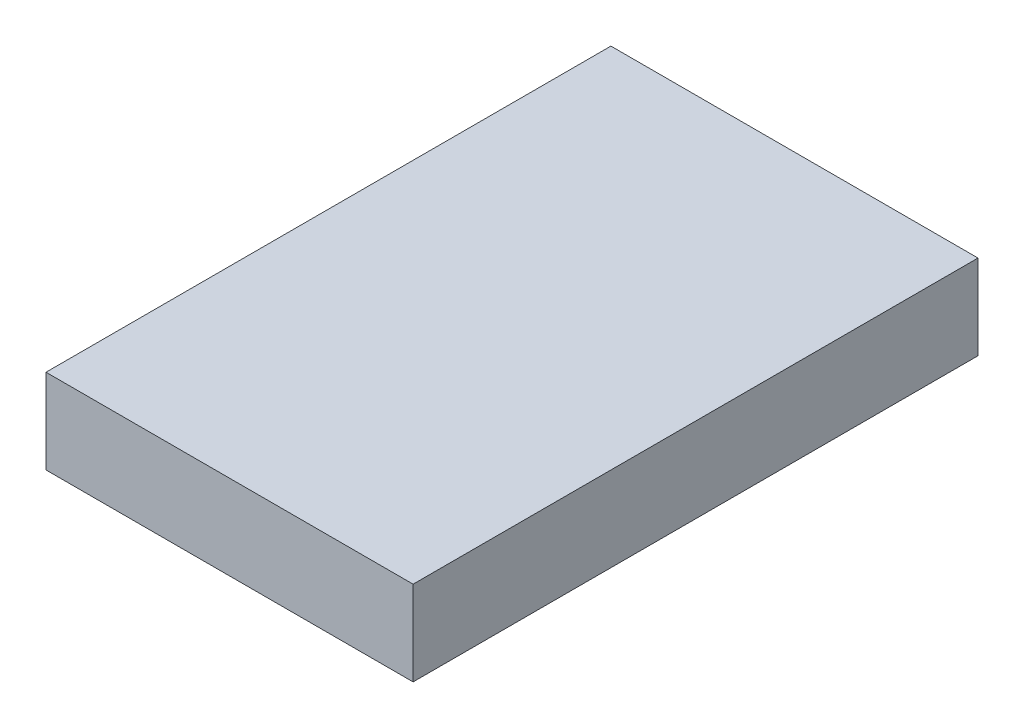
ISO-10303-21;
HEADER;
FILE_DESCRIPTION(('STEP AP214'),'2;1');
FILE_NAME('part.step','',(''),(''),'','','');
FILE_SCHEMA(('AUTOMOTIVE_DESIGN { 1 0 10303 214 1 1 1 1 }'));
ENDSEC;
DATA;
#1=APPLICATION_CONTEXT('core data for automotive mechanical design processes');
#2=APPLICATION_PROTOCOL_DEFINITION('international standard','automotive_design',2000,#1);
#3=PRODUCT_CONTEXT('',#1,'mechanical');
#4=PRODUCT('Part','Part','',(#3));
#5=PRODUCT_RELATED_PRODUCT_CATEGORY('part','',(#4));
#6=PRODUCT_DEFINITION_FORMATION('','',#4);
#7=PRODUCT_DEFINITION_CONTEXT('part definition',#1,'design');
#8=PRODUCT_DEFINITION('design','',#6,#7);
#9=PRODUCT_DEFINITION_SHAPE('','',#8);
#10=(LENGTH_UNIT() NAMED_UNIT(*) SI_UNIT(.MILLI.,.METRE.));
#11=(NAMED_UNIT(*) PLANE_ANGLE_UNIT() SI_UNIT($,.RADIAN.));
#12=(NAMED_UNIT(*) SI_UNIT($,.STERADIAN.) SOLID_ANGLE_UNIT());
#13=UNCERTAINTY_MEASURE_WITH_UNIT(LENGTH_MEASURE(1.E-05),#10,'distance_accuracy_value','');
#14=(GEOMETRIC_REPRESENTATION_CONTEXT(3) GLOBAL_UNCERTAINTY_ASSIGNED_CONTEXT((#13)) GLOBAL_UNIT_ASSIGNED_CONTEXT((#10,
#11,#12)) REPRESENTATION_CONTEXT('',''));
#15=CARTESIAN_POINT('',(0.,0.,0.));
#16=DIRECTION('',(0.,0.,1.));
#17=DIRECTION('',(1.,0.,0.));
#18=AXIS2_PLACEMENT_3D('',#15,#16,#17);
#19=CARTESIAN_POINT('',(207.9507,-20.0507,10.));
#20=DIRECTION('',(1.,0.,0.));
#21=DIRECTION('',(0.,0.,-1.));
#22=AXIS2_PLACEMENT_3D('',#19,#20,#21);
#23=PLANE('',#22);
#24=DIRECTION('',(0.,-1.,0.));
#25=VECTOR('',#24,1.);
#26=CARTESIAN_POINT('',(207.9507,-20.0507,0.));
#27=LINE('',#26,#25);
#28=CARTESIAN_POINT('',(207.9507,-20.0507,0.));
#29=VERTEX_POINT('',#28);
#30=CARTESIAN_POINT('',(207.9507,-21.5493,0.));
#31=VERTEX_POINT('',#30);
#32=EDGE_CURVE('E100',#29,#31,#27,.T.);
#33=ORIENTED_EDGE('',*,*,#32,.T.);
#34=DIRECTION('',(0.,0.,-1.));
#35=VECTOR('',#34,1.);
#36=CARTESIAN_POINT('',(207.9507,-21.5493,10.));
#37=LINE('',#36,#35);
#38=CARTESIAN_POINT('',(207.9507,-21.5493,10.));
#39=VERTEX_POINT('',#38);
#40=EDGE_CURVE('E11',#39,#31,#37,.T.);
#41=ORIENTED_EDGE('',*,*,#40,.F.);
#42=DIRECTION('',(0.,-1.,0.));
#43=VECTOR('',#42,1.);
#44=CARTESIAN_POINT('',(207.9507,-20.0507,10.));
#45=LINE('',#44,#43);
#46=CARTESIAN_POINT('',(207.9507,-20.0507,10.));
#47=VERTEX_POINT('',#46);
#48=EDGE_CURVE('E88',#47,#39,#45,.T.);
#49=ORIENTED_EDGE('',*,*,#48,.F.);
#50=DIRECTION('',(0.,0.,-1.));
#51=VECTOR('',#50,1.);
#52=CARTESIAN_POINT('',(207.9507,-20.0507,10.));
#53=LINE('',#52,#51);
#54=EDGE_CURVE('E96',#47,#29,#53,.T.);
#55=ORIENTED_EDGE('',*,*,#54,.T.);
#56=EDGE_LOOP('',(#33,#41,#49,#55));
#57=FACE_BOUND('',#56,.T.);
#58=ADVANCED_FACE('F37',(#57),#23,.F.);
#59=CARTESIAN_POINT('',(207.9507,-21.5493,10.));
#60=DIRECTION('',(0.,1.,0.));
#61=DIRECTION('',(0.,0.,1.));
#62=AXIS2_PLACEMENT_3D('',#59,#60,#61);
#63=PLANE('',#62);
#64=DIRECTION('',(1.,0.,0.));
#65=VECTOR('',#64,1.);
#66=CARTESIAN_POINT('',(207.9507,-21.5493,0.));
#67=LINE('',#66,#65);
#68=CARTESIAN_POINT('',(214.4493,-21.5493,0.));
#69=VERTEX_POINT('',#68);
#70=EDGE_CURVE('E92',#31,#69,#67,.T.);
#71=ORIENTED_EDGE('',*,*,#70,.T.);
#72=DIRECTION('',(0.,0.,-1.));
#73=VECTOR('',#72,1.);
#74=CARTESIAN_POINT('',(214.4493,-21.5493,10.));
#75=LINE('',#74,#73);
#76=CARTESIAN_POINT('',(214.4493,-21.5493,10.));
#77=VERTEX_POINT('',#76);
#78=EDGE_CURVE('E45',#77,#69,#75,.T.);
#79=ORIENTED_EDGE('',*,*,#78,.F.);
#80=DIRECTION('',(1.,0.,0.));
#81=VECTOR('',#80,1.);
#82=CARTESIAN_POINT('',(207.9507,-21.5493,10.));
#83=LINE('',#82,#81);
#84=EDGE_CURVE('E83',#39,#77,#83,.T.);
#85=ORIENTED_EDGE('',*,*,#84,.F.);
#86=ORIENTED_EDGE('',*,*,#40,.T.);
#87=EDGE_LOOP('',(#71,#79,#85,#86));
#88=FACE_BOUND('',#87,.T.);
#89=ADVANCED_FACE('F91',(#88),#63,.F.);
#90=CARTESIAN_POINT('',(214.4493,-20.0507,10.));
#91=DIRECTION('',(-1.,0.,0.));
#92=DIRECTION('',(0.,0.,1.));
#93=AXIS2_PLACEMENT_3D('',#90,#91,#92);
#94=PLANE('',#93);
#95=DIRECTION('',(0.,1.,0.));
#96=VECTOR('',#95,1.);
#97=CARTESIAN_POINT('',(214.4493,-20.0507,0.));
#98=LINE('',#97,#96);
#99=CARTESIAN_POINT('',(214.4493,-20.0507,0.));
#100=VERTEX_POINT('',#99);
#101=EDGE_CURVE('E70',#69,#100,#98,.T.);
#102=ORIENTED_EDGE('',*,*,#101,.T.);
#103=DIRECTION('',(0.,0.,-1.));
#104=VECTOR('',#103,1.);
#105=CARTESIAN_POINT('',(214.4493,-20.0507,10.));
#106=LINE('',#105,#104);
#107=CARTESIAN_POINT('',(214.4493,-20.0507,10.));
#108=VERTEX_POINT('',#107);
#109=EDGE_CURVE('E93',#108,#100,#106,.T.);
#110=ORIENTED_EDGE('',*,*,#109,.F.);
#111=DIRECTION('',(0.,1.,0.));
#112=VECTOR('',#111,1.);
#113=CARTESIAN_POINT('',(214.4493,-20.0507,10.));
#114=LINE('',#113,#112);
#115=EDGE_CURVE('E86',#77,#108,#114,.T.);
#116=ORIENTED_EDGE('',*,*,#115,.F.);
#117=ORIENTED_EDGE('',*,*,#78,.T.);
#118=EDGE_LOOP('',(#102,#110,#116,#117));
#119=FACE_BOUND('',#118,.T.);
#120=ADVANCED_FACE('F94',(#119),#94,.F.);
#121=CARTESIAN_POINT('',(207.9507,-20.0507,10.));
#122=DIRECTION('',(0.,-1.,0.));
#123=DIRECTION('',(0.,0.,-1.));
#124=AXIS2_PLACEMENT_3D('',#121,#122,#123);
#125=PLANE('',#124);
#126=DIRECTION('',(-1.,0.,0.));
#127=VECTOR('',#126,1.);
#128=CARTESIAN_POINT('',(207.9507,-20.0507,0.));
#129=LINE('',#128,#127);
#130=EDGE_CURVE('E76',#100,#29,#129,.T.);
#131=ORIENTED_EDGE('',*,*,#130,.T.);
#132=ORIENTED_EDGE('',*,*,#54,.F.);
#133=DIRECTION('',(-1.,0.,0.));
#134=VECTOR('',#133,1.);
#135=CARTESIAN_POINT('',(207.9507,-20.0507,10.));
#136=LINE('',#135,#134);
#137=EDGE_CURVE('E53',#108,#47,#136,.T.);
#138=ORIENTED_EDGE('',*,*,#137,.F.);
#139=ORIENTED_EDGE('',*,*,#109,.T.);
#140=EDGE_LOOP('',(#131,#132,#138,#139));
#141=FACE_BOUND('',#140,.T.);
#142=ADVANCED_FACE('F107',(#141),#125,.F.);
#143=CARTESIAN_POINT('',(0.,0.,10.));
#144=DIRECTION('',(0.,0.,1.));
#145=DIRECTION('',(1.,0.,0.));
#146=AXIS2_PLACEMENT_3D('',#143,#144,#145);
#147=PLANE('',#146);
#148=ORIENTED_EDGE('',*,*,#48,.T.);
#149=ORIENTED_EDGE('',*,*,#84,.T.);
#150=ORIENTED_EDGE('',*,*,#115,.T.);
#151=ORIENTED_EDGE('',*,*,#137,.T.);
#152=EDGE_LOOP('',(#148,#149,#150,#151));
#153=FACE_BOUND('',#152,.T.);
#154=ADVANCED_FACE('F84',(#153),#147,.T.);
#155=CARTESIAN_POINT('',(0.,0.,0.));
#156=DIRECTION('',(0.,0.,1.));
#157=DIRECTION('',(1.,0.,0.));
#158=AXIS2_PLACEMENT_3D('',#155,#156,#157);
#159=PLANE('',#158);
#160=ORIENTED_EDGE('',*,*,#32,.F.);
#161=ORIENTED_EDGE('',*,*,#130,.F.);
#162=ORIENTED_EDGE('',*,*,#101,.F.);
#163=ORIENTED_EDGE('',*,*,#70,.F.);
#164=EDGE_LOOP('',(#160,#161,#162,#163));
#165=FACE_BOUND('',#164,.T.);
#166=ADVANCED_FACE('F110',(#165),#159,.F.);
#167=CLOSED_SHELL('',(#58,#89,#120,#142,#154,#166));
#168=MANIFOLD_SOLID_BREP('B2',#167);
#169=ADVANCED_BREP_SHAPE_REPRESENTATION('',(#18,#168),#14);
#170=SHAPE_DEFINITION_REPRESENTATION(#9,#169);
ENDSEC;
END-ISO-10303-21;
